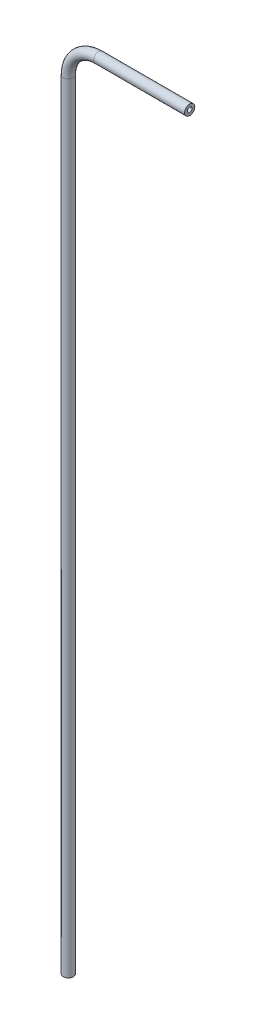
ISO-10303-21;
HEADER;
FILE_DESCRIPTION(('STEP AP214'),'2;1');
FILE_NAME('part.step','',(''),(''),'','','');
FILE_SCHEMA(('AUTOMOTIVE_DESIGN { 1 0 10303 214 1 1 1 1 }'));
ENDSEC;
DATA;
#1=APPLICATION_CONTEXT('core data for automotive mechanical design processes');
#2=APPLICATION_PROTOCOL_DEFINITION('international standard','automotive_design',2000,#1);
#3=PRODUCT_CONTEXT('',#1,'mechanical');
#4=PRODUCT('Part','Part','',(#3));
#5=PRODUCT_RELATED_PRODUCT_CATEGORY('part','',(#4));
#6=PRODUCT_DEFINITION_FORMATION('','',#4);
#7=PRODUCT_DEFINITION_CONTEXT('part definition',#1,'design');
#8=PRODUCT_DEFINITION('design','',#6,#7);
#9=PRODUCT_DEFINITION_SHAPE('','',#8);
#10=(LENGTH_UNIT() NAMED_UNIT(*) SI_UNIT(.MILLI.,.METRE.));
#11=(NAMED_UNIT(*) PLANE_ANGLE_UNIT() SI_UNIT($,.RADIAN.));
#12=(NAMED_UNIT(*) SI_UNIT($,.STERADIAN.) SOLID_ANGLE_UNIT());
#13=UNCERTAINTY_MEASURE_WITH_UNIT(LENGTH_MEASURE(1.E-05),#10,'distance_accuracy_value','');
#14=(GEOMETRIC_REPRESENTATION_CONTEXT(3) GLOBAL_UNCERTAINTY_ASSIGNED_CONTEXT((#13)) GLOBAL_UNIT_ASSIGNED_CONTEXT((#10,
#11,#12)) REPRESENTATION_CONTEXT('',''));
#15=CARTESIAN_POINT('',(0.,0.,0.));
#16=DIRECTION('',(0.,0.,1.));
#17=DIRECTION('',(1.,0.,0.));
#18=AXIS2_PLACEMENT_3D('',#15,#16,#17);
#19=CARTESIAN_POINT('',(0.,-490.472317880795,0.));
#20=DIRECTION('',(0.,1.,0.));
#21=DIRECTION('',(0.,0.,1.));
#22=AXIS2_PLACEMENT_3D('',#19,#20,#21);
#23=CYLINDRICAL_SURFACE('',#22,3.175);
#24=CARTESIAN_POINT('',(0.,-1.52231788079482,0.));
#25=DIRECTION('',(0.,1.,0.));
#26=DIRECTION('',(0.,0.,-1.));
#27=AXIS2_PLACEMENT_3D('',#24,#25,#26);
#28=CIRCLE('',#27,3.175);
#29=CARTESIAN_POINT('',(-3.175,-1.52231788079484,0.));
#30=VERTEX_POINT('',#29);
#31=EDGE_CURVE('E90',#30,#30,#28,.T.);
#32=ORIENTED_EDGE('',*,*,#31,.F.);
#33=EDGE_LOOP('',(#32));
#34=FACE_BOUND('',#33,.T.);
#35=CARTESIAN_POINT('',(0.,-490.472317880795,0.));
#36=DIRECTION('',(0.,1.,0.));
#37=DIRECTION('',(0.,0.,-1.));
#38=AXIS2_PLACEMENT_3D('',#35,#36,#37);
#39=CIRCLE('',#38,3.175);
#40=CARTESIAN_POINT('',(0.,-490.472317880795,-3.175));
#41=VERTEX_POINT('',#40);
#42=EDGE_CURVE('E55',#41,#41,#39,.T.);
#43=ORIENTED_EDGE('',*,*,#42,.T.);
#44=EDGE_LOOP('',(#43));
#45=FACE_BOUND('',#44,.T.);
#46=ADVANCED_FACE('F39',(#34,#45),#23,.T.);
#47=CARTESIAN_POINT('',(19.05,-1.52231788079469,0.));
#48=DIRECTION('',(0.,0.,-1.));
#49=DIRECTION('',(-1.,0.,0.));
#50=AXIS2_PLACEMENT_3D('',#47,#48,#49);
#51=TOROIDAL_SURFACE('',#50,19.05,3.175);
#52=CARTESIAN_POINT('',(19.05,17.5276821192058,0.));
#53=DIRECTION('',(1.,0.,0.));
#54=DIRECTION('',(0.,0.,-1.));
#55=AXIS2_PLACEMENT_3D('',#52,#53,#54);
#56=CIRCLE('',#55,3.175);
#57=CARTESIAN_POINT('',(19.05,20.7026821192053,0.));
#58=VERTEX_POINT('',#57);
#59=EDGE_CURVE('E43',#58,#58,#56,.T.);
#60=CARTESIAN_POINT('',(19.05,-1.52231788079469,0.));
#61=DIRECTION('',(0.,0.,-1.));
#62=DIRECTION('',(-1.,0.,0.));
#63=AXIS2_PLACEMENT_3D('',#60,#61,#62);
#64=CIRCLE('',#63,22.225);
#65=EDGE_CURVE('',#30,#58,#64,.T.);
#66=ORIENTED_EDGE('',*,*,#31,.T.);
#67=ORIENTED_EDGE('',*,*,#59,.F.);
#68=ORIENTED_EDGE('',*,*,#65,.T.);
#69=ORIENTED_EDGE('',*,*,#65,.F.);
#70=EDGE_LOOP('',(#66,#68,#67,#69));
#71=FACE_BOUND('',#70,.T.);
#72=ADVANCED_FACE('F100',(#71),#51,.T.);
#73=CARTESIAN_POINT('',(19.0500000000001,17.5276821192053,0.));
#74=DIRECTION('',(1.,0.,0.));
#75=DIRECTION('',(0.,0.,-1.));
#76=AXIS2_PLACEMENT_3D('',#73,#74,#75);
#77=CYLINDRICAL_SURFACE('',#76,3.175);
#78=CARTESIAN_POINT('',(76.2,17.5276821192053,0.));
#79=DIRECTION('',(1.,0.,0.));
#80=DIRECTION('',(0.,0.,-1.));
#81=AXIS2_PLACEMENT_3D('',#78,#79,#80);
#82=CIRCLE('',#81,3.175);
#83=CARTESIAN_POINT('',(76.2,17.5276821192053,-3.175));
#84=VERTEX_POINT('',#83);
#85=EDGE_CURVE('E60',#84,#84,#82,.T.);
#86=ORIENTED_EDGE('',*,*,#85,.F.);
#87=EDGE_LOOP('',(#86));
#88=FACE_BOUND('',#87,.T.);
#89=ORIENTED_EDGE('',*,*,#59,.T.);
#90=EDGE_LOOP('',(#89));
#91=FACE_BOUND('',#90,.T.);
#92=ADVANCED_FACE('F41',(#88,#91),#77,.T.);
#93=CARTESIAN_POINT('',(0.,-490.472317880795,0.));
#94=DIRECTION('',(0.,1.,0.));
#95=DIRECTION('',(0.,0.,-1.));
#96=AXIS2_PLACEMENT_3D('',#93,#94,#95);
#97=PLANE('',#96);
#98=CARTESIAN_POINT('',(0.,-490.472317880795,0.));
#99=DIRECTION('',(0.,1.,0.));
#100=DIRECTION('',(0.,0.,-1.));
#101=AXIS2_PLACEMENT_3D('',#98,#99,#100);
#102=CIRCLE('',#101,1.524);
#103=CARTESIAN_POINT('',(0.,-490.472317880795,-1.524));
#104=VERTEX_POINT('',#103);
#105=EDGE_CURVE('E83',#104,#104,#102,.F.);
#106=ORIENTED_EDGE('',*,*,#105,.F.);
#107=EDGE_LOOP('',(#106));
#108=FACE_BOUND('',#107,.T.);
#109=ORIENTED_EDGE('',*,*,#42,.F.);
#110=EDGE_LOOP('',(#109));
#111=FACE_BOUND('',#110,.T.);
#112=ADVANCED_FACE('F106',(#108,#111),#97,.F.);
#113=CARTESIAN_POINT('',(76.2,17.5276821192053,0.));
#114=DIRECTION('',(1.,0.,0.));
#115=DIRECTION('',(0.,0.,-1.));
#116=AXIS2_PLACEMENT_3D('',#113,#114,#115);
#117=PLANE('',#116);
#118=CARTESIAN_POINT('',(76.2,17.5276821192053,0.));
#119=DIRECTION('',(1.,0.,0.));
#120=DIRECTION('',(0.,0.,-1.));
#121=AXIS2_PLACEMENT_3D('',#118,#119,#120);
#122=CIRCLE('',#121,1.524);
#123=CARTESIAN_POINT('',(76.2,17.5276821192053,-1.524));
#124=VERTEX_POINT('',#123);
#125=EDGE_CURVE('E11',#124,#124,#122,.F.);
#126=ORIENTED_EDGE('',*,*,#125,.T.);
#127=EDGE_LOOP('',(#126));
#128=FACE_BOUND('',#127,.T.);
#129=ORIENTED_EDGE('',*,*,#85,.T.);
#130=EDGE_LOOP('',(#129));
#131=FACE_BOUND('',#130,.T.);
#132=ADVANCED_FACE('F67',(#128,#131),#117,.T.);
#133=CARTESIAN_POINT('',(0.,-490.472317880795,0.));
#134=DIRECTION('',(0.,1.,0.));
#135=DIRECTION('',(0.,0.,1.));
#136=AXIS2_PLACEMENT_3D('',#133,#134,#135);
#137=CYLINDRICAL_SURFACE('',#136,1.524);
#138=CARTESIAN_POINT('',(0.,-1.52231788079482,0.));
#139=DIRECTION('',(0.,1.,0.));
#140=DIRECTION('',(0.,0.,-1.));
#141=AXIS2_PLACEMENT_3D('',#138,#139,#140);
#142=CIRCLE('',#141,1.524);
#143=CARTESIAN_POINT('',(-1.524,-1.52231788079483,0.));
#144=VERTEX_POINT('',#143);
#145=EDGE_CURVE('E79',#144,#144,#142,.F.);
#146=ORIENTED_EDGE('',*,*,#145,.F.);
#147=EDGE_LOOP('',(#146));
#148=FACE_BOUND('',#147,.T.);
#149=ORIENTED_EDGE('',*,*,#105,.T.);
#150=EDGE_LOOP('',(#149));
#151=FACE_BOUND('',#150,.T.);
#152=ADVANCED_FACE('F114',(#148,#151),#137,.F.);
#153=CARTESIAN_POINT('',(19.05,-1.52231788079469,0.));
#154=DIRECTION('',(0.,0.,-1.));
#155=DIRECTION('',(-1.,0.,0.));
#156=AXIS2_PLACEMENT_3D('',#153,#154,#155);
#157=TOROIDAL_SURFACE('',#156,19.05,1.524);
#158=CARTESIAN_POINT('',(19.05,17.5276821192058,0.));
#159=DIRECTION('',(1.,0.,0.));
#160=DIRECTION('',(0.,0.,-1.));
#161=AXIS2_PLACEMENT_3D('',#158,#159,#160);
#162=CIRCLE('',#161,1.524);
#163=CARTESIAN_POINT('',(19.05,19.0516821192053,0.));
#164=VERTEX_POINT('',#163);
#165=EDGE_CURVE('E49',#164,#164,#162,.F.);
#166=CARTESIAN_POINT('',(19.05,-1.52231788079469,0.));
#167=DIRECTION('',(0.,0.,-1.));
#168=DIRECTION('',(-1.,0.,0.));
#169=AXIS2_PLACEMENT_3D('',#166,#167,#168);
#170=CIRCLE('',#169,20.574);
#171=EDGE_CURVE('',#144,#164,#170,.T.);
#172=ORIENTED_EDGE('',*,*,#145,.T.);
#173=ORIENTED_EDGE('',*,*,#165,.F.);
#174=ORIENTED_EDGE('',*,*,#171,.T.);
#175=ORIENTED_EDGE('',*,*,#171,.F.);
#176=EDGE_LOOP('',(#172,#174,#173,#175));
#177=FACE_BOUND('',#176,.T.);
#178=ADVANCED_FACE('F73',(#177),#157,.F.);
#179=CARTESIAN_POINT('',(19.0500000000001,17.5276821192053,0.));
#180=DIRECTION('',(1.,0.,0.));
#181=DIRECTION('',(0.,0.,-1.));
#182=AXIS2_PLACEMENT_3D('',#179,#180,#181);
#183=CYLINDRICAL_SURFACE('',#182,1.524);
#184=ORIENTED_EDGE('',*,*,#125,.F.);
#185=EDGE_LOOP('',(#184));
#186=FACE_BOUND('',#185,.T.);
#187=ORIENTED_EDGE('',*,*,#165,.T.);
#188=EDGE_LOOP('',(#187));
#189=FACE_BOUND('',#188,.T.);
#190=ADVANCED_FACE('F70',(#186,#189),#183,.F.);
#191=CLOSED_SHELL('',(#46,#72,#92,#112,#132,#152,#178,#190));
#192=MANIFOLD_SOLID_BREP('B2',#191);
#193=ADVANCED_BREP_SHAPE_REPRESENTATION('',(#18,#192),#14);
#194=SHAPE_DEFINITION_REPRESENTATION(#9,#193);
ENDSEC;
END-ISO-10303-21;
